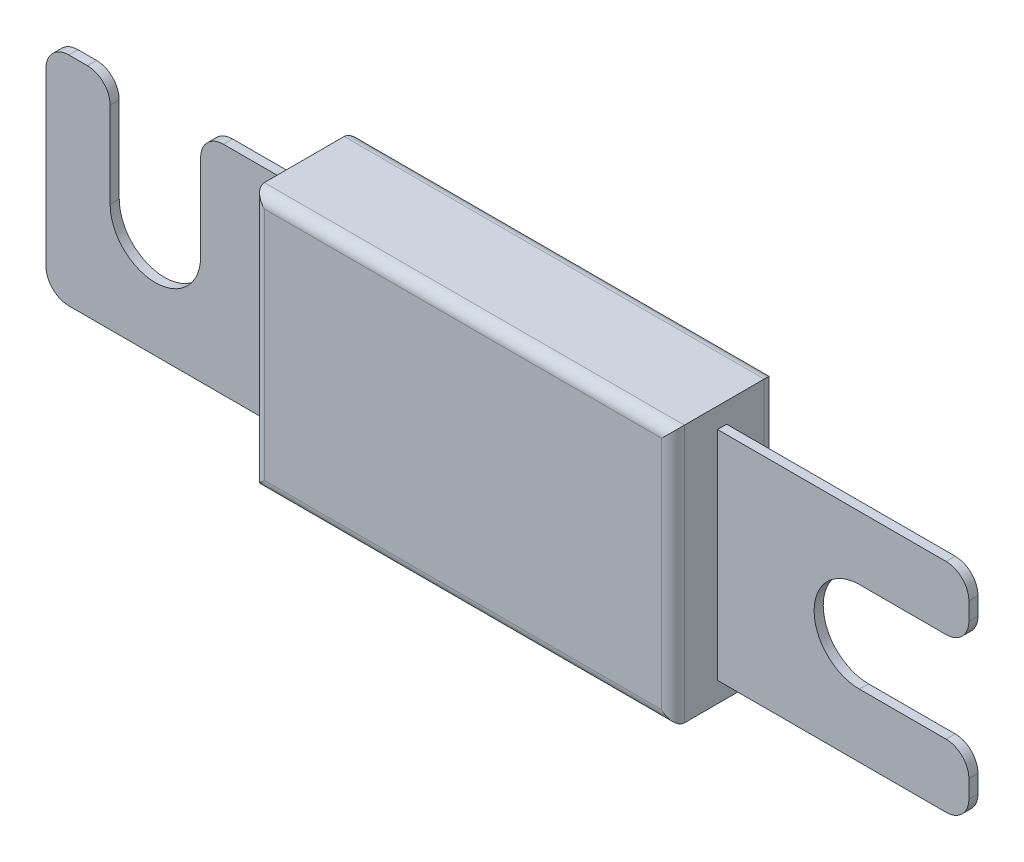
ISO-10303-21;
HEADER;
FILE_DESCRIPTION(('STEP AP214'),'2;1');
FILE_NAME('part.step','',(''),(''),'','','');
FILE_SCHEMA(('AUTOMOTIVE_DESIGN { 1 0 10303 214 1 1 1 1 }'));
ENDSEC;
DATA;
#1=APPLICATION_CONTEXT('core data for automotive mechanical design processes');
#2=APPLICATION_PROTOCOL_DEFINITION('international standard','automotive_design',2000,#1);
#3=PRODUCT_CONTEXT('',#1,'mechanical');
#4=PRODUCT('Part','Part','',(#3));
#5=PRODUCT_RELATED_PRODUCT_CATEGORY('part','',(#4));
#6=PRODUCT_DEFINITION_FORMATION('','',#4);
#7=PRODUCT_DEFINITION_CONTEXT('part definition',#1,'design');
#8=PRODUCT_DEFINITION('design','',#6,#7);
#9=PRODUCT_DEFINITION_SHAPE('','',#8);
#10=(LENGTH_UNIT() NAMED_UNIT(*) SI_UNIT(.MILLI.,.METRE.));
#11=(NAMED_UNIT(*) PLANE_ANGLE_UNIT() SI_UNIT($,.RADIAN.));
#12=(NAMED_UNIT(*) SI_UNIT($,.STERADIAN.) SOLID_ANGLE_UNIT());
#13=UNCERTAINTY_MEASURE_WITH_UNIT(LENGTH_MEASURE(1.E-05),#10,'distance_accuracy_value','');
#14=(GEOMETRIC_REPRESENTATION_CONTEXT(3) GLOBAL_UNCERTAINTY_ASSIGNED_CONTEXT((#13)) GLOBAL_UNIT_ASSIGNED_CONTEXT((#10,
#11,#12)) REPRESENTATION_CONTEXT('',''));
#15=CARTESIAN_POINT('',(0.,0.,0.));
#16=DIRECTION('',(0.,0.,1.));
#17=DIRECTION('',(1.,0.,0.));
#18=AXIS2_PLACEMENT_3D('',#15,#16,#17);
#19=CARTESIAN_POINT('',(78.91,0.,0.8));
#20=DIRECTION('',(0.,1.,0.));
#21=DIRECTION('',(-1.,0.,0.));
#22=AXIS2_PLACEMENT_3D('',#19,#20,#21);
#23=PLANE('',#22);
#24=DIRECTION('',(1.,0.,0.));
#25=VECTOR('',#24,1.);
#26=CARTESIAN_POINT('',(78.91,0.,0.));
#27=LINE('',#26,#25);
#28=CARTESIAN_POINT('',(2.00000000000002,0.,0.));
#29=VERTEX_POINT('',#28);
#30=CARTESIAN_POINT('',(22.04,0.,0.));
#31=VERTEX_POINT('',#30);
#32=EDGE_CURVE('E257',#29,#31,#27,.T.);
#33=ORIENTED_EDGE('',*,*,#32,.T.);
#34=DIRECTION('',(0.,0.,1.));
#35=VECTOR('',#34,1.);
#36=CARTESIAN_POINT('',(22.04,0.,0.8));
#37=LINE('',#36,#35);
#38=CARTESIAN_POINT('',(22.04,0.,0.8));
#39=VERTEX_POINT('',#38);
#40=EDGE_CURVE('E581',#31,#39,#37,.T.);
#41=ORIENTED_EDGE('',*,*,#40,.T.);
#42=DIRECTION('',(1.,0.,0.));
#43=VECTOR('',#42,1.);
#44=CARTESIAN_POINT('',(78.91,0.,0.8));
#45=LINE('',#44,#43);
#46=CARTESIAN_POINT('',(2.00000000000002,0.,0.8));
#47=VERTEX_POINT('',#46);
#48=EDGE_CURVE('E555',#47,#39,#45,.T.);
#49=ORIENTED_EDGE('',*,*,#48,.F.);
#50=DIRECTION('',(0.,0.,-1.));
#51=VECTOR('',#50,1.);
#52=CARTESIAN_POINT('',(2.00000000000002,0.,0.8));
#53=LINE('',#52,#51);
#54=EDGE_CURVE('E501',#47,#29,#53,.T.);
#55=ORIENTED_EDGE('',*,*,#54,.T.);
#56=EDGE_LOOP('',(#33,#41,#49,#55));
#57=FACE_BOUND('',#56,.T.);
#58=ADVANCED_FACE('F34',(#57),#23,.F.);
#59=CARTESIAN_POINT('',(15.55875,19.05,0.8));
#60=DIRECTION('',(0.,-1.,0.));
#61=DIRECTION('',(0.,0.,-1.));
#62=AXIS2_PLACEMENT_3D('',#59,#60,#61);
#63=PLANE('',#62);
#64=DIRECTION('',(-1.,0.,0.));
#65=VECTOR('',#64,1.);
#66=CARTESIAN_POINT('',(15.55875,19.05,0.8));
#67=LINE('',#66,#65);
#68=CARTESIAN_POINT('',(22.04,19.05,0.8));
#69=VERTEX_POINT('',#68);
#70=CARTESIAN_POINT('',(15.55875,19.05,0.8));
#71=VERTEX_POINT('',#70);
#72=EDGE_CURVE('E575',#69,#71,#67,.T.);
#73=ORIENTED_EDGE('',*,*,#72,.F.);
#74=DIRECTION('',(0.,0.,-1.));
#75=VECTOR('',#74,1.);
#76=CARTESIAN_POINT('',(22.04,19.05,0.8));
#77=LINE('',#76,#75);
#78=CARTESIAN_POINT('',(22.04,19.05,0.));
#79=VERTEX_POINT('',#78);
#80=EDGE_CURVE('E586',#69,#79,#77,.T.);
#81=ORIENTED_EDGE('',*,*,#80,.T.);
#82=DIRECTION('',(-1.,0.,0.));
#83=VECTOR('',#82,1.);
#84=CARTESIAN_POINT('',(15.55875,19.05,0.));
#85=LINE('',#84,#83);
#86=CARTESIAN_POINT('',(15.55875,19.05,0.));
#87=VERTEX_POINT('',#86);
#88=EDGE_CURVE('E471',#79,#87,#85,.T.);
#89=ORIENTED_EDGE('',*,*,#88,.T.);
#90=DIRECTION('',(0.,0.,-1.));
#91=VECTOR('',#90,1.);
#92=CARTESIAN_POINT('',(15.55875,19.05,0.8));
#93=LINE('',#92,#91);
#94=EDGE_CURVE('E475',#71,#87,#93,.T.);
#95=ORIENTED_EDGE('',*,*,#94,.F.);
#96=EDGE_LOOP('',(#73,#81,#89,#95));
#97=FACE_BOUND('',#96,.T.);
#98=ADVANCED_FACE('F375',(#97),#63,.F.);
#99=CARTESIAN_POINT('',(15.55875,17.05,0.8));
#100=DIRECTION('',(0.,0.,-1.));
#101=DIRECTION('',(-1.,0.,0.));
#102=AXIS2_PLACEMENT_3D('',#99,#100,#101);
#103=PLANE('',#102);
#104=ORIENTED_EDGE('',*,*,#48,.T.);
#105=DIRECTION('',(0.,1.,0.));
#106=VECTOR('',#105,1.);
#107=CARTESIAN_POINT('',(22.04,17.05,0.8));
#108=LINE('',#107,#106);
#109=EDGE_CURVE('E578',#39,#69,#108,.T.);
#110=ORIENTED_EDGE('',*,*,#109,.T.);
#111=ORIENTED_EDGE('',*,*,#72,.T.);
#112=CARTESIAN_POINT('',(15.55875,17.05,0.8));
#113=DIRECTION('',(0.,0.,1.));
#114=DIRECTION('',(-1.,0.,0.));
#115=AXIS2_PLACEMENT_3D('',#112,#113,#114);
#116=CIRCLE('',#115,2.);
#117=CARTESIAN_POINT('',(13.55875,17.05,0.8));
#118=VERTEX_POINT('',#117);
#119=EDGE_CURVE('E474',#71,#118,#116,.T.);
#120=ORIENTED_EDGE('',*,*,#119,.T.);
#121=DIRECTION('',(0.,-1.,0.));
#122=VECTOR('',#121,1.);
#123=CARTESIAN_POINT('',(13.55875,9.525,0.8));
#124=LINE('',#123,#122);
#125=CARTESIAN_POINT('',(13.55875,9.525,0.8));
#126=VERTEX_POINT('',#125);
#127=EDGE_CURVE('E592',#118,#126,#124,.T.);
#128=ORIENTED_EDGE('',*,*,#127,.T.);
#129=CARTESIAN_POINT('',(9.59,9.525,0.8));
#130=DIRECTION('',(0.,0.,-1.));
#131=DIRECTION('',(1.,0.,0.));
#132=AXIS2_PLACEMENT_3D('',#129,#130,#131);
#133=CIRCLE('',#132,3.96875);
#134=CARTESIAN_POINT('',(5.62125,9.525,0.8));
#135=VERTEX_POINT('',#134);
#136=EDGE_CURVE('E529',#126,#135,#133,.T.);
#137=ORIENTED_EDGE('',*,*,#136,.T.);
#138=DIRECTION('',(0.,1.,0.));
#139=VECTOR('',#138,1.);
#140=CARTESIAN_POINT('',(5.62125,9.525,0.8));
#141=LINE('',#140,#139);
#142=CARTESIAN_POINT('',(5.62125,17.05,0.8));
#143=VERTEX_POINT('',#142);
#144=EDGE_CURVE('E595',#135,#143,#141,.T.);
#145=ORIENTED_EDGE('',*,*,#144,.T.);
#146=CARTESIAN_POINT('',(3.62125,17.05,0.8));
#147=DIRECTION('',(0.,0.,1.));
#148=DIRECTION('',(1.,0.,0.));
#149=AXIS2_PLACEMENT_3D('',#146,#147,#148);
#150=CIRCLE('',#149,2.);
#151=CARTESIAN_POINT('',(3.62124999999998,19.05,0.8));
#152=VERTEX_POINT('',#151);
#153=EDGE_CURVE('E597',#143,#152,#150,.T.);
#154=ORIENTED_EDGE('',*,*,#153,.T.);
#155=DIRECTION('',(-1.,0.,0.));
#156=VECTOR('',#155,1.);
#157=CARTESIAN_POINT('',(2.00000000000003,19.05,0.8));
#158=LINE('',#157,#156);
#159=CARTESIAN_POINT('',(2.00000000000003,19.05,0.8));
#160=VERTEX_POINT('',#159);
#161=EDGE_CURVE('E599',#152,#160,#158,.T.);
#162=ORIENTED_EDGE('',*,*,#161,.T.);
#163=CARTESIAN_POINT('',(2.00000000000001,17.05,0.8));
#164=DIRECTION('',(0.,0.,1.));
#165=DIRECTION('',(-1.,0.,0.));
#166=AXIS2_PLACEMENT_3D('',#163,#164,#165);
#167=CIRCLE('',#166,2.);
#168=CARTESIAN_POINT('',(0.,17.05,0.8));
#169=VERTEX_POINT('',#168);
#170=EDGE_CURVE('E601',#160,#169,#167,.T.);
#171=ORIENTED_EDGE('',*,*,#170,.T.);
#172=DIRECTION('',(0.,-1.,0.));
#173=VECTOR('',#172,1.);
#174=CARTESIAN_POINT('',(0.,2.00000000000002,0.8));
#175=LINE('',#174,#173);
#176=CARTESIAN_POINT('',(0.,2.00000000000002,0.8));
#177=VERTEX_POINT('',#176);
#178=EDGE_CURVE('E603',#169,#177,#175,.T.);
#179=ORIENTED_EDGE('',*,*,#178,.T.);
#180=CARTESIAN_POINT('',(2.,2.,0.8));
#181=DIRECTION('',(0.,0.,1.));
#182=DIRECTION('',(1.,0.,0.));
#183=AXIS2_PLACEMENT_3D('',#180,#181,#182);
#184=CIRCLE('',#183,2.);
#185=EDGE_CURVE('E604',#177,#47,#184,.T.);
#186=ORIENTED_EDGE('',*,*,#185,.T.);
#187=EDGE_LOOP('',(#104,#110,#111,#120,#128,#137,#145,#154,#162,#171,#179,#186));
#188=FACE_BOUND('',#187,.T.);
#189=ADVANCED_FACE('F381',(#188),#103,.F.);
#190=CARTESIAN_POINT('',(15.55875,17.05,0.));
#191=DIRECTION('',(0.,0.,-1.));
#192=DIRECTION('',(-1.,0.,0.));
#193=AXIS2_PLACEMENT_3D('',#190,#191,#192);
#194=PLANE('',#193);
#195=DIRECTION('',(0.,1.,0.));
#196=VECTOR('',#195,1.);
#197=CARTESIAN_POINT('',(22.04,17.05,0.));
#198=LINE('',#197,#196);
#199=EDGE_CURVE('E272',#31,#79,#198,.T.);
#200=ORIENTED_EDGE('',*,*,#199,.F.);
#201=ORIENTED_EDGE('',*,*,#32,.F.);
#202=CARTESIAN_POINT('',(2.,2.,0.));
#203=DIRECTION('',(0.,0.,1.));
#204=DIRECTION('',(1.,0.,0.));
#205=AXIS2_PLACEMENT_3D('',#202,#203,#204);
#206=CIRCLE('',#205,2.);
#207=CARTESIAN_POINT('',(0.,2.00000000000002,0.));
#208=VERTEX_POINT('',#207);
#209=EDGE_CURVE('E258',#208,#29,#206,.T.);
#210=ORIENTED_EDGE('',*,*,#209,.F.);
#211=DIRECTION('',(0.,-1.,0.));
#212=VECTOR('',#211,1.);
#213=CARTESIAN_POINT('',(0.,2.00000000000002,0.));
#214=LINE('',#213,#212);
#215=CARTESIAN_POINT('',(0.,17.05,0.));
#216=VERTEX_POINT('',#215);
#217=EDGE_CURVE('E549',#216,#208,#214,.T.);
#218=ORIENTED_EDGE('',*,*,#217,.F.);
#219=CARTESIAN_POINT('',(2.00000000000001,17.05,0.));
#220=DIRECTION('',(0.,0.,1.));
#221=DIRECTION('',(-1.,0.,0.));
#222=AXIS2_PLACEMENT_3D('',#219,#220,#221);
#223=CIRCLE('',#222,2.);
#224=CARTESIAN_POINT('',(2.00000000000003,19.05,0.));
#225=VERTEX_POINT('',#224);
#226=EDGE_CURVE('E547',#225,#216,#223,.T.);
#227=ORIENTED_EDGE('',*,*,#226,.F.);
#228=DIRECTION('',(-1.,0.,0.));
#229=VECTOR('',#228,1.);
#230=CARTESIAN_POINT('',(2.00000000000003,19.05,0.));
#231=LINE('',#230,#229);
#232=CARTESIAN_POINT('',(3.62124999999998,19.05,0.));
#233=VERTEX_POINT('',#232);
#234=EDGE_CURVE('E545',#233,#225,#231,.T.);
#235=ORIENTED_EDGE('',*,*,#234,.F.);
#236=CARTESIAN_POINT('',(3.62125,17.05,0.));
#237=DIRECTION('',(0.,0.,1.));
#238=DIRECTION('',(1.,0.,0.));
#239=AXIS2_PLACEMENT_3D('',#236,#237,#238);
#240=CIRCLE('',#239,2.);
#241=CARTESIAN_POINT('',(5.62125,17.05,0.));
#242=VERTEX_POINT('',#241);
#243=EDGE_CURVE('E538',#242,#233,#240,.T.);
#244=ORIENTED_EDGE('',*,*,#243,.F.);
#245=DIRECTION('',(0.,1.,0.));
#246=VECTOR('',#245,1.);
#247=CARTESIAN_POINT('',(5.62125,9.525,0.));
#248=LINE('',#247,#246);
#249=CARTESIAN_POINT('',(5.62125,9.525,0.));
#250=VERTEX_POINT('',#249);
#251=EDGE_CURVE('E536',#250,#242,#248,.T.);
#252=ORIENTED_EDGE('',*,*,#251,.F.);
#253=CARTESIAN_POINT('',(9.59,9.525,0.));
#254=DIRECTION('',(0.,0.,-1.));
#255=DIRECTION('',(1.,0.,0.));
#256=AXIS2_PLACEMENT_3D('',#253,#254,#255);
#257=CIRCLE('',#256,3.96875);
#258=CARTESIAN_POINT('',(13.55875,9.525,0.));
#259=VERTEX_POINT('',#258);
#260=EDGE_CURVE('E528',#259,#250,#257,.T.);
#261=ORIENTED_EDGE('',*,*,#260,.F.);
#262=DIRECTION('',(0.,-1.,0.));
#263=VECTOR('',#262,1.);
#264=CARTESIAN_POINT('',(13.55875,9.525,0.));
#265=LINE('',#264,#263);
#266=CARTESIAN_POINT('',(13.55875,17.05,0.));
#267=VERTEX_POINT('',#266);
#268=EDGE_CURVE('E534',#267,#259,#265,.T.);
#269=ORIENTED_EDGE('',*,*,#268,.F.);
#270=CARTESIAN_POINT('',(15.55875,17.05,0.));
#271=DIRECTION('',(0.,0.,1.));
#272=DIRECTION('',(-1.,0.,0.));
#273=AXIS2_PLACEMENT_3D('',#270,#271,#272);
#274=CIRCLE('',#273,2.);
#275=EDGE_CURVE('E540',#87,#267,#274,.T.);
#276=ORIENTED_EDGE('',*,*,#275,.F.);
#277=ORIENTED_EDGE('',*,*,#88,.F.);
#278=EDGE_LOOP('',(#200,#201,#210,#218,#227,#235,#244,#252,#261,#269,#276,#277));
#279=FACE_BOUND('',#278,.T.);
#280=ADVANCED_FACE('F402',(#279),#194,.T.);
#281=CARTESIAN_POINT('',(15.55875,17.05,0.8));
#282=DIRECTION('',(0.,0.,-1.));
#283=DIRECTION('',(-1.,0.,0.));
#284=AXIS2_PLACEMENT_3D('',#281,#282,#283);
#285=CYLINDRICAL_SURFACE('',#284,2.);
#286=ORIENTED_EDGE('',*,*,#275,.T.);
#287=DIRECTION('',(0.,0.,-1.));
#288=VECTOR('',#287,1.);
#289=CARTESIAN_POINT('',(13.55875,17.05,0.8));
#290=LINE('',#289,#288);
#291=EDGE_CURVE('E273',#118,#267,#290,.T.);
#292=ORIENTED_EDGE('',*,*,#291,.F.);
#293=ORIENTED_EDGE('',*,*,#119,.F.);
#294=ORIENTED_EDGE('',*,*,#94,.T.);
#295=EDGE_LOOP('',(#286,#292,#293,#294));
#296=FACE_BOUND('',#295,.T.);
#297=ADVANCED_FACE('F651',(#296),#285,.T.);
#298=CARTESIAN_POINT('',(13.55875,9.525,0.8));
#299=DIRECTION('',(1.,0.,0.));
#300=DIRECTION('',(0.,0.,-1.));
#301=AXIS2_PLACEMENT_3D('',#298,#299,#300);
#302=PLANE('',#301);
#303=ORIENTED_EDGE('',*,*,#268,.T.);
#304=DIRECTION('',(0.,0.,-1.));
#305=VECTOR('',#304,1.);
#306=CARTESIAN_POINT('',(13.55875,9.525,0.8));
#307=LINE('',#306,#305);
#308=EDGE_CURVE('E279',#126,#259,#307,.T.);
#309=ORIENTED_EDGE('',*,*,#308,.F.);
#310=ORIENTED_EDGE('',*,*,#127,.F.);
#311=ORIENTED_EDGE('',*,*,#291,.T.);
#312=EDGE_LOOP('',(#303,#309,#310,#311));
#313=FACE_BOUND('',#312,.T.);
#314=ADVANCED_FACE('F657',(#313),#302,.F.);
#315=CARTESIAN_POINT('',(9.59,9.525,0.8));
#316=DIRECTION('',(0.,0.,-1.));
#317=DIRECTION('',(-1.,0.,0.));
#318=AXIS2_PLACEMENT_3D('',#315,#316,#317);
#319=CYLINDRICAL_SURFACE('',#318,3.96875);
#320=ORIENTED_EDGE('',*,*,#260,.T.);
#321=DIRECTION('',(0.,0.,-1.));
#322=VECTOR('',#321,1.);
#323=CARTESIAN_POINT('',(5.62125,9.525,0.8));
#324=LINE('',#323,#322);
#325=EDGE_CURVE('E519',#135,#250,#324,.T.);
#326=ORIENTED_EDGE('',*,*,#325,.F.);
#327=ORIENTED_EDGE('',*,*,#136,.F.);
#328=ORIENTED_EDGE('',*,*,#308,.T.);
#329=EDGE_LOOP('',(#320,#326,#327,#328));
#330=FACE_BOUND('',#329,.T.);
#331=ADVANCED_FACE('F526',(#330),#319,.F.);
#332=CARTESIAN_POINT('',(5.62125,9.525,0.8));
#333=DIRECTION('',(-1.,0.,0.));
#334=DIRECTION('',(0.,0.,1.));
#335=AXIS2_PLACEMENT_3D('',#332,#333,#334);
#336=PLANE('',#335);
#337=ORIENTED_EDGE('',*,*,#251,.T.);
#338=DIRECTION('',(0.,0.,-1.));
#339=VECTOR('',#338,1.);
#340=CARTESIAN_POINT('',(5.62125,17.05,0.8));
#341=LINE('',#340,#339);
#342=EDGE_CURVE('E516',#143,#242,#341,.T.);
#343=ORIENTED_EDGE('',*,*,#342,.F.);
#344=ORIENTED_EDGE('',*,*,#144,.F.);
#345=ORIENTED_EDGE('',*,*,#325,.T.);
#346=EDGE_LOOP('',(#337,#343,#344,#345));
#347=FACE_BOUND('',#346,.T.);
#348=ADVANCED_FACE('F664',(#347),#336,.F.);
#349=CARTESIAN_POINT('',(3.62125,17.05,0.8));
#350=DIRECTION('',(0.,0.,-1.));
#351=DIRECTION('',(-1.,0.,0.));
#352=AXIS2_PLACEMENT_3D('',#349,#350,#351);
#353=CYLINDRICAL_SURFACE('',#352,2.);
#354=ORIENTED_EDGE('',*,*,#243,.T.);
#355=DIRECTION('',(0.,0.,-1.));
#356=VECTOR('',#355,1.);
#357=CARTESIAN_POINT('',(3.62124999999998,19.05,0.8));
#358=LINE('',#357,#356);
#359=EDGE_CURVE('E513',#152,#233,#358,.T.);
#360=ORIENTED_EDGE('',*,*,#359,.F.);
#361=ORIENTED_EDGE('',*,*,#153,.F.);
#362=ORIENTED_EDGE('',*,*,#342,.T.);
#363=EDGE_LOOP('',(#354,#360,#361,#362));
#364=FACE_BOUND('',#363,.T.);
#365=ADVANCED_FACE('F905',(#364),#353,.T.);
#366=CARTESIAN_POINT('',(2.00000000000003,19.05,0.8));
#367=DIRECTION('',(0.,-1.,0.));
#368=DIRECTION('',(0.,0.,-1.));
#369=AXIS2_PLACEMENT_3D('',#366,#367,#368);
#370=PLANE('',#369);
#371=ORIENTED_EDGE('',*,*,#234,.T.);
#372=DIRECTION('',(0.,0.,-1.));
#373=VECTOR('',#372,1.);
#374=CARTESIAN_POINT('',(2.00000000000003,19.05,0.8));
#375=LINE('',#374,#373);
#376=EDGE_CURVE('E510',#160,#225,#375,.T.);
#377=ORIENTED_EDGE('',*,*,#376,.F.);
#378=ORIENTED_EDGE('',*,*,#161,.F.);
#379=ORIENTED_EDGE('',*,*,#359,.T.);
#380=EDGE_LOOP('',(#371,#377,#378,#379));
#381=FACE_BOUND('',#380,.T.);
#382=ADVANCED_FACE('F895',(#381),#370,.F.);
#383=CARTESIAN_POINT('',(2.00000000000001,17.05,0.8));
#384=DIRECTION('',(0.,0.,-1.));
#385=DIRECTION('',(-1.,0.,0.));
#386=AXIS2_PLACEMENT_3D('',#383,#384,#385);
#387=CYLINDRICAL_SURFACE('',#386,2.);
#388=ORIENTED_EDGE('',*,*,#226,.T.);
#389=DIRECTION('',(0.,0.,-1.));
#390=VECTOR('',#389,1.);
#391=CARTESIAN_POINT('',(0.,17.05,0.8));
#392=LINE('',#391,#390);
#393=EDGE_CURVE('E507',#169,#216,#392,.T.);
#394=ORIENTED_EDGE('',*,*,#393,.F.);
#395=ORIENTED_EDGE('',*,*,#170,.F.);
#396=ORIENTED_EDGE('',*,*,#376,.T.);
#397=EDGE_LOOP('',(#388,#394,#395,#396));
#398=FACE_BOUND('',#397,.T.);
#399=ADVANCED_FACE('F885',(#398),#387,.T.);
#400=CARTESIAN_POINT('',(0.,2.00000000000002,0.8));
#401=DIRECTION('',(1.,0.,0.));
#402=DIRECTION('',(0.,1.,0.));
#403=AXIS2_PLACEMENT_3D('',#400,#401,#402);
#404=PLANE('',#403);
#405=ORIENTED_EDGE('',*,*,#217,.T.);
#406=DIRECTION('',(0.,0.,-1.));
#407=VECTOR('',#406,1.);
#408=CARTESIAN_POINT('',(0.,2.00000000000002,0.8));
#409=LINE('',#408,#407);
#410=EDGE_CURVE('E504',#177,#208,#409,.T.);
#411=ORIENTED_EDGE('',*,*,#410,.F.);
#412=ORIENTED_EDGE('',*,*,#178,.F.);
#413=ORIENTED_EDGE('',*,*,#393,.T.);
#414=EDGE_LOOP('',(#405,#411,#412,#413));
#415=FACE_BOUND('',#414,.T.);
#416=ADVANCED_FACE('F876',(#415),#404,.F.);
#417=CARTESIAN_POINT('',(2.,2.,0.8));
#418=DIRECTION('',(0.,0.,-1.));
#419=DIRECTION('',(-1.,0.,0.));
#420=AXIS2_PLACEMENT_3D('',#417,#418,#419);
#421=CYLINDRICAL_SURFACE('',#420,2.);
#422=ORIENTED_EDGE('',*,*,#209,.T.);
#423=ORIENTED_EDGE('',*,*,#54,.F.);
#424=ORIENTED_EDGE('',*,*,#185,.F.);
#425=ORIENTED_EDGE('',*,*,#410,.T.);
#426=EDGE_LOOP('',(#422,#423,#424,#425));
#427=FACE_BOUND('',#426,.T.);
#428=ADVANCED_FACE('F640',(#427),#421,.T.);
#429=CARTESIAN_POINT('',(22.04,20.83,-4.3));
#430=DIRECTION('',(-1.,0.,0.));
#431=DIRECTION('',(0.,-1.,0.));
#432=AXIS2_PLACEMENT_3D('',#429,#430,#431);
#433=PLANE('',#432);
#434=DIRECTION('',(0.,0.,1.));
#435=VECTOR('',#434,1.);
#436=CARTESIAN_POINT('',(22.04,-1.78,-4.3));
#437=LINE('',#436,#435);
#438=CARTESIAN_POINT('',(22.04,-1.78,-3.3));
#439=VERTEX_POINT('',#438);
#440=CARTESIAN_POINT('',(22.04,-1.78,3.7));
#441=VERTEX_POINT('',#440);
#442=EDGE_CURVE('E311',#439,#441,#437,.T.);
#443=ORIENTED_EDGE('',*,*,#442,.T.);
#444=DIRECTION('',(0.,-1.,0.));
#445=VECTOR('',#444,1.);
#446=CARTESIAN_POINT('',(22.04,20.83,3.7));
#447=LINE('',#446,#445);
#448=CARTESIAN_POINT('',(22.04,20.83,3.7));
#449=VERTEX_POINT('',#448);
#450=EDGE_CURVE('E320',#441,#449,#447,.F.);
#451=ORIENTED_EDGE('',*,*,#450,.T.);
#452=DIRECTION('',(0.,0.,1.));
#453=VECTOR('',#452,1.);
#454=CARTESIAN_POINT('',(22.04,20.83,-4.3));
#455=LINE('',#454,#453);
#456=CARTESIAN_POINT('',(22.04,20.83,-3.3));
#457=VERTEX_POINT('',#456);
#458=EDGE_CURVE('E611',#457,#449,#455,.T.);
#459=ORIENTED_EDGE('',*,*,#458,.F.);
#460=DIRECTION('',(0.,-1.,0.));
#461=VECTOR('',#460,1.);
#462=CARTESIAN_POINT('',(22.04,20.83,-3.3));
#463=LINE('',#462,#461);
#464=EDGE_CURVE('E276',#457,#439,#463,.T.);
#465=ORIENTED_EDGE('',*,*,#464,.T.);
#466=EDGE_LOOP('',(#443,#451,#459,#465));
#467=FACE_BOUND('',#466,.T.);
#468=ORIENTED_EDGE('',*,*,#109,.F.);
#469=ORIENTED_EDGE('',*,*,#40,.F.);
#470=ORIENTED_EDGE('',*,*,#199,.T.);
#471=ORIENTED_EDGE('',*,*,#80,.F.);
#472=EDGE_LOOP('',(#468,#469,#470,#471));
#473=FACE_BOUND('',#472,.T.);
#474=ADVANCED_FACE('F351',(#467,#473),#433,.T.);
#475=CARTESIAN_POINT('',(58.87,20.83,-4.3));
#476=DIRECTION('',(1.,0.,0.));
#477=DIRECTION('',(0.,0.,-1.));
#478=AXIS2_PLACEMENT_3D('',#475,#476,#477);
#479=PLANE('',#478);
#480=DIRECTION('',(0.,0.,1.));
#481=VECTOR('',#480,1.);
#482=CARTESIAN_POINT('',(58.87,20.83,-4.3));
#483=LINE('',#482,#481);
#484=CARTESIAN_POINT('',(58.87,20.83,-3.3));
#485=VERTEX_POINT('',#484);
#486=CARTESIAN_POINT('',(58.87,20.83,3.7));
#487=VERTEX_POINT('',#486);
#488=EDGE_CURVE('E614',#485,#487,#483,.T.);
#489=ORIENTED_EDGE('',*,*,#488,.T.);
#490=DIRECTION('',(0.,1.,0.));
#491=VECTOR('',#490,1.);
#492=CARTESIAN_POINT('',(58.87,-1.77999999999999,3.7));
#493=LINE('',#492,#491);
#494=CARTESIAN_POINT('',(58.87,-1.77999999999999,3.7));
#495=VERTEX_POINT('',#494);
#496=EDGE_CURVE('E43',#487,#495,#493,.F.);
#497=ORIENTED_EDGE('',*,*,#496,.T.);
#498=DIRECTION('',(0.,0.,1.));
#499=VECTOR('',#498,1.);
#500=CARTESIAN_POINT('',(58.87,-1.77999999999999,-4.3));
#501=LINE('',#500,#499);
#502=CARTESIAN_POINT('',(58.87,-1.77999999999999,-3.3));
#503=VERTEX_POINT('',#502);
#504=EDGE_CURVE('E348',#503,#495,#501,.T.);
#505=ORIENTED_EDGE('',*,*,#504,.F.);
#506=DIRECTION('',(0.,1.,0.));
#507=VECTOR('',#506,1.);
#508=CARTESIAN_POINT('',(58.87,20.83,-3.3));
#509=LINE('',#508,#507);
#510=EDGE_CURVE('E296',#503,#485,#509,.T.);
#511=ORIENTED_EDGE('',*,*,#510,.T.);
#512=EDGE_LOOP('',(#489,#497,#505,#511));
#513=FACE_BOUND('',#512,.T.);
#514=DIRECTION('',(0.,-1.,0.));
#515=VECTOR('',#514,1.);
#516=CARTESIAN_POINT('',(58.87,17.05,0.8));
#517=LINE('',#516,#515);
#518=CARTESIAN_POINT('',(58.87,19.05,0.8));
#519=VERTEX_POINT('',#518);
#520=CARTESIAN_POINT('',(58.87,0.,0.8));
#521=VERTEX_POINT('',#520);
#522=EDGE_CURVE('E267',#519,#521,#517,.T.);
#523=ORIENTED_EDGE('',*,*,#522,.F.);
#524=DIRECTION('',(0.,0.,1.));
#525=VECTOR('',#524,1.);
#526=CARTESIAN_POINT('',(58.87,19.05,0.8));
#527=LINE('',#526,#525);
#528=CARTESIAN_POINT('',(58.87,19.05,0.));
#529=VERTEX_POINT('',#528);
#530=EDGE_CURVE('E268',#529,#519,#527,.T.);
#531=ORIENTED_EDGE('',*,*,#530,.F.);
#532=DIRECTION('',(0.,-1.,0.));
#533=VECTOR('',#532,1.);
#534=CARTESIAN_POINT('',(58.87,17.05,0.));
#535=LINE('',#534,#533);
#536=CARTESIAN_POINT('',(58.87,0.,0.));
#537=VERTEX_POINT('',#536);
#538=EDGE_CURVE('E250',#529,#537,#535,.T.);
#539=ORIENTED_EDGE('',*,*,#538,.T.);
#540=DIRECTION('',(0.,0.,-1.));
#541=VECTOR('',#540,1.);
#542=CARTESIAN_POINT('',(58.87,0.,0.8));
#543=LINE('',#542,#541);
#544=EDGE_CURVE('E262',#521,#537,#543,.T.);
#545=ORIENTED_EDGE('',*,*,#544,.F.);
#546=EDGE_LOOP('',(#523,#531,#539,#545));
#547=FACE_BOUND('',#546,.T.);
#548=ADVANCED_FACE('F271',(#513,#547),#479,.T.);
#549=CARTESIAN_POINT('',(58.87,20.83,-4.3));
#550=DIRECTION('',(0.,1.,0.));
#551=DIRECTION('',(-1.,0.,0.));
#552=AXIS2_PLACEMENT_3D('',#549,#550,#551);
#553=PLANE('',#552);
#554=ORIENTED_EDGE('',*,*,#458,.T.);
#555=DIRECTION('',(-1.,0.,0.));
#556=VECTOR('',#555,1.);
#557=CARTESIAN_POINT('',(58.87,20.83,3.7));
#558=LINE('',#557,#556);
#559=EDGE_CURVE('E58',#449,#487,#558,.F.);
#560=ORIENTED_EDGE('',*,*,#559,.T.);
#561=ORIENTED_EDGE('',*,*,#488,.F.);
#562=DIRECTION('',(-1.,0.,0.));
#563=VECTOR('',#562,1.);
#564=CARTESIAN_POINT('',(58.87,20.83,-3.3));
#565=LINE('',#564,#563);
#566=EDGE_CURVE('E294',#485,#457,#565,.T.);
#567=ORIENTED_EDGE('',*,*,#566,.T.);
#568=EDGE_LOOP('',(#554,#560,#561,#567));
#569=FACE_BOUND('',#568,.T.);
#570=ADVANCED_FACE('F616',(#569),#553,.T.);
#571=CARTESIAN_POINT('',(58.87,-1.77999999999999,-4.3));
#572=DIRECTION('',(0.,-1.,0.));
#573=DIRECTION('',(1.,0.,0.));
#574=AXIS2_PLACEMENT_3D('',#571,#572,#573);
#575=PLANE('',#574);
#576=ORIENTED_EDGE('',*,*,#504,.T.);
#577=DIRECTION('',(1.,0.,0.));
#578=VECTOR('',#577,1.);
#579=CARTESIAN_POINT('',(22.04,-1.78,3.7));
#580=LINE('',#579,#578);
#581=EDGE_CURVE('E11',#495,#441,#580,.F.);
#582=ORIENTED_EDGE('',*,*,#581,.T.);
#583=ORIENTED_EDGE('',*,*,#442,.F.);
#584=DIRECTION('',(1.,0.,0.));
#585=VECTOR('',#584,1.);
#586=CARTESIAN_POINT('',(58.87,-1.77999999999999,-3.3));
#587=LINE('',#586,#585);
#588=EDGE_CURVE('E298',#439,#503,#587,.T.);
#589=ORIENTED_EDGE('',*,*,#588,.T.);
#590=EDGE_LOOP('',(#576,#582,#583,#589));
#591=FACE_BOUND('',#590,.T.);
#592=ADVANCED_FACE('F347',(#591),#575,.T.);
#593=CARTESIAN_POINT('',(0.,0.,-4.3));
#594=DIRECTION('',(0.,0.,-1.));
#595=DIRECTION('',(-1.,0.,0.));
#596=AXIS2_PLACEMENT_3D('',#593,#594,#595);
#597=PLANE('',#596);
#598=DIRECTION('',(1.,0.,0.));
#599=VECTOR('',#598,1.);
#600=CARTESIAN_POINT('',(0.,-0.78,-4.3));
#601=LINE('',#600,#599);
#602=CARTESIAN_POINT('',(57.87,-0.779999999999992,-4.3));
#603=VERTEX_POINT('',#602);
#604=CARTESIAN_POINT('',(23.04,-0.779999999999997,-4.3));
#605=VERTEX_POINT('',#604);
#606=EDGE_CURVE('E285',#603,#605,#601,.F.);
#607=ORIENTED_EDGE('',*,*,#606,.T.);
#608=DIRECTION('',(0.,-1.,0.));
#609=VECTOR('',#608,1.);
#610=CARTESIAN_POINT('',(23.04,0.,-4.3));
#611=LINE('',#610,#609);
#612=CARTESIAN_POINT('',(23.04,19.83,-4.3));
#613=VERTEX_POINT('',#612);
#614=EDGE_CURVE('E291',#605,#613,#611,.F.);
#615=ORIENTED_EDGE('',*,*,#614,.T.);
#616=DIRECTION('',(-1.,0.,0.));
#617=VECTOR('',#616,1.);
#618=CARTESIAN_POINT('',(0.,19.83,-4.3));
#619=LINE('',#618,#617);
#620=CARTESIAN_POINT('',(57.87,19.83,-4.3));
#621=VERTEX_POINT('',#620);
#622=EDGE_CURVE('E289',#613,#621,#619,.F.);
#623=ORIENTED_EDGE('',*,*,#622,.T.);
#624=DIRECTION('',(0.,1.,0.));
#625=VECTOR('',#624,1.);
#626=CARTESIAN_POINT('',(57.87,0.,-4.3));
#627=LINE('',#626,#625);
#628=EDGE_CURVE('E287',#621,#603,#627,.F.);
#629=ORIENTED_EDGE('',*,*,#628,.T.);
#630=EDGE_LOOP('',(#607,#615,#623,#629));
#631=FACE_BOUND('',#630,.T.);
#632=ADVANCED_FACE('F363',(#631),#597,.T.);
#633=CARTESIAN_POINT('',(0.,0.,4.7));
#634=DIRECTION('',(0.,0.,-1.));
#635=DIRECTION('',(-1.,0.,0.));
#636=AXIS2_PLACEMENT_3D('',#633,#634,#635);
#637=PLANE('',#636);
#638=DIRECTION('',(-1.,0.,0.));
#639=VECTOR('',#638,1.);
#640=CARTESIAN_POINT('',(22.04,19.83,4.7));
#641=LINE('',#640,#639);
#642=CARTESIAN_POINT('',(57.87,19.83,4.7));
#643=VERTEX_POINT('',#642);
#644=CARTESIAN_POINT('',(23.04,19.83,4.7));
#645=VERTEX_POINT('',#644);
#646=EDGE_CURVE('E315',#643,#645,#641,.T.);
#647=ORIENTED_EDGE('',*,*,#646,.T.);
#648=DIRECTION('',(0.,-1.,0.));
#649=VECTOR('',#648,1.);
#650=CARTESIAN_POINT('',(23.04,-1.78,4.7));
#651=LINE('',#650,#649);
#652=CARTESIAN_POINT('',(23.04,-0.779999999999997,4.7));
#653=VERTEX_POINT('',#652);
#654=EDGE_CURVE('E317',#645,#653,#651,.T.);
#655=ORIENTED_EDGE('',*,*,#654,.T.);
#656=DIRECTION('',(1.,0.,0.));
#657=VECTOR('',#656,1.);
#658=CARTESIAN_POINT('',(58.87,-0.779999999999992,4.7));
#659=LINE('',#658,#657);
#660=CARTESIAN_POINT('',(57.87,-0.779999999999992,4.7));
#661=VERTEX_POINT('',#660);
#662=EDGE_CURVE('E300',#653,#661,#659,.T.);
#663=ORIENTED_EDGE('',*,*,#662,.T.);
#664=DIRECTION('',(0.,1.,0.));
#665=VECTOR('',#664,1.);
#666=CARTESIAN_POINT('',(57.87,20.83,4.7));
#667=LINE('',#666,#665);
#668=EDGE_CURVE('E313',#661,#643,#667,.T.);
#669=ORIENTED_EDGE('',*,*,#668,.T.);
#670=EDGE_LOOP('',(#647,#655,#663,#669));
#671=FACE_BOUND('',#670,.T.);
#672=ADVANCED_FACE('F360',(#671),#637,.F.);
#673=CARTESIAN_POINT('',(78.91,2.,0.8));
#674=DIRECTION('',(0.,0.,-1.));
#675=DIRECTION('',(-1.,0.,0.));
#676=AXIS2_PLACEMENT_3D('',#673,#674,#675);
#677=CYLINDRICAL_SURFACE('',#676,2.);
#678=CARTESIAN_POINT('',(78.91,2.,0.));
#679=DIRECTION('',(0.,0.,1.));
#680=DIRECTION('',(-1.,0.,0.));
#681=AXIS2_PLACEMENT_3D('',#678,#679,#680);
#682=CIRCLE('',#681,2.);
#683=CARTESIAN_POINT('',(78.91,0.,0.));
#684=VERTEX_POINT('',#683);
#685=CARTESIAN_POINT('',(80.91,2.00000000000001,0.));
#686=VERTEX_POINT('',#685);
#687=EDGE_CURVE('E253',#684,#686,#682,.T.);
#688=ORIENTED_EDGE('',*,*,#687,.T.);
#689=DIRECTION('',(0.,0.,-1.));
#690=VECTOR('',#689,1.);
#691=CARTESIAN_POINT('',(80.91,2.00000000000001,0.8));
#692=LINE('',#691,#690);
#693=CARTESIAN_POINT('',(80.91,2.00000000000001,0.8));
#694=VERTEX_POINT('',#693);
#695=EDGE_CURVE('E445',#694,#686,#692,.T.);
#696=ORIENTED_EDGE('',*,*,#695,.F.);
#697=CARTESIAN_POINT('',(78.91,2.,0.8));
#698=DIRECTION('',(0.,0.,1.));
#699=DIRECTION('',(-1.,0.,0.));
#700=AXIS2_PLACEMENT_3D('',#697,#698,#699);
#701=CIRCLE('',#700,2.);
#702=CARTESIAN_POINT('',(78.91,0.,0.8));
#703=VERTEX_POINT('',#702);
#704=EDGE_CURVE('E552',#703,#694,#701,.T.);
#705=ORIENTED_EDGE('',*,*,#704,.F.);
#706=DIRECTION('',(0.,0.,-1.));
#707=VECTOR('',#706,1.);
#708=CARTESIAN_POINT('',(78.91,0.,0.8));
#709=LINE('',#708,#707);
#710=EDGE_CURVE('E499',#703,#684,#709,.T.);
#711=ORIENTED_EDGE('',*,*,#710,.T.);
#712=EDGE_LOOP('',(#688,#696,#705,#711));
#713=FACE_BOUND('',#712,.T.);
#714=ADVANCED_FACE('F362',(#713),#677,.T.);
#715=CARTESIAN_POINT('',(80.91,3.55624999999999,0.8));
#716=DIRECTION('',(-1.,0.,0.));
#717=DIRECTION('',(0.,0.,1.));
#718=AXIS2_PLACEMENT_3D('',#715,#716,#717);
#719=PLANE('',#718);
#720=DIRECTION('',(0.,1.,0.));
#721=VECTOR('',#720,1.);
#722=CARTESIAN_POINT('',(80.91,3.55624999999999,0.));
#723=LINE('',#722,#721);
#724=CARTESIAN_POINT('',(80.91,3.55624999999999,0.));
#725=VERTEX_POINT('',#724);
#726=EDGE_CURVE('E439',#686,#725,#723,.T.);
#727=ORIENTED_EDGE('',*,*,#726,.T.);
#728=DIRECTION('',(0.,0.,-1.));
#729=VECTOR('',#728,1.);
#730=CARTESIAN_POINT('',(80.91,3.55624999999999,0.8));
#731=LINE('',#730,#729);
#732=CARTESIAN_POINT('',(80.91,3.55624999999999,0.8));
#733=VERTEX_POINT('',#732);
#734=EDGE_CURVE('E442',#733,#725,#731,.T.);
#735=ORIENTED_EDGE('',*,*,#734,.F.);
#736=DIRECTION('',(0.,1.,0.));
#737=VECTOR('',#736,1.);
#738=CARTESIAN_POINT('',(80.91,3.55624999999999,0.8));
#739=LINE('',#738,#737);
#740=EDGE_CURVE('E554',#694,#733,#739,.T.);
#741=ORIENTED_EDGE('',*,*,#740,.F.);
#742=ORIENTED_EDGE('',*,*,#695,.T.);
#743=EDGE_LOOP('',(#727,#735,#741,#742));
#744=FACE_BOUND('',#743,.T.);
#745=ADVANCED_FACE('F369',(#744),#719,.F.);
#746=CARTESIAN_POINT('',(78.91,3.55625000000001,0.8));
#747=DIRECTION('',(0.,0.,-1.));
#748=DIRECTION('',(-1.,0.,0.));
#749=AXIS2_PLACEMENT_3D('',#746,#747,#748);
#750=CYLINDRICAL_SURFACE('',#749,1.99999999999999);
#751=CARTESIAN_POINT('',(78.91,3.55625000000001,0.));
#752=DIRECTION('',(0.,0.,1.));
#753=DIRECTION('',(-1.,0.,0.));
#754=AXIS2_PLACEMENT_3D('',#751,#752,#753);
#755=CIRCLE('',#754,1.99999999999999);
#756=CARTESIAN_POINT('',(78.91,5.55625,0.));
#757=VERTEX_POINT('',#756);
#758=EDGE_CURVE('E447',#725,#757,#755,.T.);
#759=ORIENTED_EDGE('',*,*,#758,.T.);
#760=DIRECTION('',(0.,0.,-1.));
#761=VECTOR('',#760,1.);
#762=CARTESIAN_POINT('',(78.91,5.55625,0.8));
#763=LINE('',#762,#761);
#764=CARTESIAN_POINT('',(78.91,5.55625,0.8));
#765=VERTEX_POINT('',#764);
#766=EDGE_CURVE('E452',#765,#757,#763,.T.);
#767=ORIENTED_EDGE('',*,*,#766,.F.);
#768=CARTESIAN_POINT('',(78.91,3.55625000000001,0.8));
#769=DIRECTION('',(0.,0.,1.));
#770=DIRECTION('',(-1.,0.,0.));
#771=AXIS2_PLACEMENT_3D('',#768,#769,#770);
#772=CIRCLE('',#771,1.99999999999999);
#773=EDGE_CURVE('E451',#733,#765,#772,.T.);
#774=ORIENTED_EDGE('',*,*,#773,.F.);
#775=ORIENTED_EDGE('',*,*,#734,.T.);
#776=EDGE_LOOP('',(#759,#767,#774,#775));
#777=FACE_BOUND('',#776,.T.);
#778=ADVANCED_FACE('F428',(#777),#750,.T.);
#779=CARTESIAN_POINT('',(71.31,5.55625000000001,0.8));
#780=DIRECTION('',(0.,-1.,0.));
#781=DIRECTION('',(1.,0.,0.));
#782=AXIS2_PLACEMENT_3D('',#779,#780,#781);
#783=PLANE('',#782);
#784=DIRECTION('',(-1.,0.,0.));
#785=VECTOR('',#784,1.);
#786=CARTESIAN_POINT('',(71.31,5.55625000000001,0.));
#787=LINE('',#786,#785);
#788=CARTESIAN_POINT('',(71.31,5.55625000000001,0.));
#789=VERTEX_POINT('',#788);
#790=EDGE_CURVE('E456',#757,#789,#787,.T.);
#791=ORIENTED_EDGE('',*,*,#790,.T.);
#792=DIRECTION('',(0.,0.,-1.));
#793=VECTOR('',#792,1.);
#794=CARTESIAN_POINT('',(71.31,5.55625000000001,0.8));
#795=LINE('',#794,#793);
#796=CARTESIAN_POINT('',(71.31,5.55625000000001,0.8));
#797=VERTEX_POINT('',#796);
#798=EDGE_CURVE('E494',#797,#789,#795,.T.);
#799=ORIENTED_EDGE('',*,*,#798,.F.);
#800=DIRECTION('',(-1.,0.,0.));
#801=VECTOR('',#800,1.);
#802=CARTESIAN_POINT('',(71.31,5.55625000000001,0.8));
#803=LINE('',#802,#801);
#804=EDGE_CURVE('E563',#765,#797,#803,.T.);
#805=ORIENTED_EDGE('',*,*,#804,.F.);
#806=ORIENTED_EDGE('',*,*,#766,.T.);
#807=EDGE_LOOP('',(#791,#799,#805,#806));
#808=FACE_BOUND('',#807,.T.);
#809=ADVANCED_FACE('F424',(#808),#783,.F.);
#810=CARTESIAN_POINT('',(71.31,9.525,0.8));
#811=DIRECTION('',(0.,0.,-1.));
#812=DIRECTION('',(-1.,0.,0.));
#813=AXIS2_PLACEMENT_3D('',#810,#811,#812);
#814=CYLINDRICAL_SURFACE('',#813,3.96874999999999);
#815=CARTESIAN_POINT('',(71.31,9.525,0.));
#816=DIRECTION('',(0.,0.,-1.));
#817=DIRECTION('',(1.,0.,0.));
#818=AXIS2_PLACEMENT_3D('',#815,#816,#817);
#819=CIRCLE('',#818,3.96874999999999);
#820=CARTESIAN_POINT('',(71.31,13.49375,0.));
#821=VERTEX_POINT('',#820);
#822=EDGE_CURVE('E458',#789,#821,#819,.T.);
#823=ORIENTED_EDGE('',*,*,#822,.T.);
#824=DIRECTION('',(0.,0.,-1.));
#825=VECTOR('',#824,1.);
#826=CARTESIAN_POINT('',(71.31,13.49375,0.8));
#827=LINE('',#826,#825);
#828=CARTESIAN_POINT('',(71.31,13.49375,0.8));
#829=VERTEX_POINT('',#828);
#830=EDGE_CURVE('E491',#829,#821,#827,.T.);
#831=ORIENTED_EDGE('',*,*,#830,.F.);
#832=CARTESIAN_POINT('',(71.31,9.525,0.8));
#833=DIRECTION('',(0.,0.,-1.));
#834=DIRECTION('',(1.,0.,0.));
#835=AXIS2_PLACEMENT_3D('',#832,#833,#834);
#836=CIRCLE('',#835,3.96874999999999);
#837=EDGE_CURVE('E565',#797,#829,#836,.T.);
#838=ORIENTED_EDGE('',*,*,#837,.F.);
#839=ORIENTED_EDGE('',*,*,#798,.T.);
#840=EDGE_LOOP('',(#823,#831,#838,#839));
#841=FACE_BOUND('',#840,.T.);
#842=ADVANCED_FACE('F420',(#841),#814,.F.);
#843=CARTESIAN_POINT('',(71.31,13.49375,0.8));
#844=DIRECTION('',(0.,1.,0.));
#845=DIRECTION('',(0.,0.,1.));
#846=AXIS2_PLACEMENT_3D('',#843,#844,#845);
#847=PLANE('',#846);
#848=DIRECTION('',(1.,0.,0.));
#849=VECTOR('',#848,1.);
#850=CARTESIAN_POINT('',(71.31,13.49375,0.));
#851=LINE('',#850,#849);
#852=CARTESIAN_POINT('',(78.91,13.49375,0.));
#853=VERTEX_POINT('',#852);
#854=EDGE_CURVE('E463',#821,#853,#851,.T.);
#855=ORIENTED_EDGE('',*,*,#854,.T.);
#856=DIRECTION('',(0.,0.,-1.));
#857=VECTOR('',#856,1.);
#858=CARTESIAN_POINT('',(78.91,13.49375,0.8));
#859=LINE('',#858,#857);
#860=CARTESIAN_POINT('',(78.91,13.49375,0.8));
#861=VERTEX_POINT('',#860);
#862=EDGE_CURVE('E488',#861,#853,#859,.T.);
#863=ORIENTED_EDGE('',*,*,#862,.F.);
#864=DIRECTION('',(1.,0.,0.));
#865=VECTOR('',#864,1.);
#866=CARTESIAN_POINT('',(71.31,13.49375,0.8));
#867=LINE('',#866,#865);
#868=EDGE_CURVE('E567',#829,#861,#867,.T.);
#869=ORIENTED_EDGE('',*,*,#868,.F.);
#870=ORIENTED_EDGE('',*,*,#830,.T.);
#871=EDGE_LOOP('',(#855,#863,#869,#870));
#872=FACE_BOUND('',#871,.T.);
#873=ADVANCED_FACE('F416',(#872),#847,.F.);
#874=CARTESIAN_POINT('',(78.91,15.49375,0.8));
#875=DIRECTION('',(0.,0.,-1.));
#876=DIRECTION('',(-1.,0.,0.));
#877=AXIS2_PLACEMENT_3D('',#874,#875,#876);
#878=CYLINDRICAL_SURFACE('',#877,2.);
#879=CARTESIAN_POINT('',(78.91,15.49375,0.));
#880=DIRECTION('',(0.,0.,1.));
#881=DIRECTION('',(1.,0.,0.));
#882=AXIS2_PLACEMENT_3D('',#879,#880,#881);
#883=CIRCLE('',#882,2.);
#884=CARTESIAN_POINT('',(80.91,15.49375,0.));
#885=VERTEX_POINT('',#884);
#886=EDGE_CURVE('E465',#853,#885,#883,.T.);
#887=ORIENTED_EDGE('',*,*,#886,.T.);
#888=DIRECTION('',(0.,0.,-1.));
#889=VECTOR('',#888,1.);
#890=CARTESIAN_POINT('',(80.91,15.49375,0.8));
#891=LINE('',#890,#889);
#892=CARTESIAN_POINT('',(80.91,15.49375,0.8));
#893=VERTEX_POINT('',#892);
#894=EDGE_CURVE('E485',#893,#885,#891,.T.);
#895=ORIENTED_EDGE('',*,*,#894,.F.);
#896=CARTESIAN_POINT('',(78.91,15.49375,0.8));
#897=DIRECTION('',(0.,0.,1.));
#898=DIRECTION('',(1.,0.,0.));
#899=AXIS2_PLACEMENT_3D('',#896,#897,#898);
#900=CIRCLE('',#899,2.);
#901=EDGE_CURVE('E569',#861,#893,#900,.T.);
#902=ORIENTED_EDGE('',*,*,#901,.F.);
#903=ORIENTED_EDGE('',*,*,#862,.T.);
#904=EDGE_LOOP('',(#887,#895,#902,#903));
#905=FACE_BOUND('',#904,.T.);
#906=ADVANCED_FACE('F412',(#905),#878,.T.);
#907=CARTESIAN_POINT('',(80.91,17.05,0.8));
#908=DIRECTION('',(-1.,0.,0.));
#909=DIRECTION('',(0.,0.,1.));
#910=AXIS2_PLACEMENT_3D('',#907,#908,#909);
#911=PLANE('',#910);
#912=DIRECTION('',(0.,1.,0.));
#913=VECTOR('',#912,1.);
#914=CARTESIAN_POINT('',(80.91,17.05,0.));
#915=LINE('',#914,#913);
#916=CARTESIAN_POINT('',(80.91,17.05,0.));
#917=VERTEX_POINT('',#916);
#918=EDGE_CURVE('E467',#885,#917,#915,.T.);
#919=ORIENTED_EDGE('',*,*,#918,.T.);
#920=DIRECTION('',(0.,0.,-1.));
#921=VECTOR('',#920,1.);
#922=CARTESIAN_POINT('',(80.91,17.05,0.8));
#923=LINE('',#922,#921);
#924=CARTESIAN_POINT('',(80.91,17.05,0.8));
#925=VERTEX_POINT('',#924);
#926=EDGE_CURVE('E482',#925,#917,#923,.T.);
#927=ORIENTED_EDGE('',*,*,#926,.F.);
#928=DIRECTION('',(0.,1.,0.));
#929=VECTOR('',#928,1.);
#930=CARTESIAN_POINT('',(80.91,17.05,0.8));
#931=LINE('',#930,#929);
#932=EDGE_CURVE('E571',#893,#925,#931,.T.);
#933=ORIENTED_EDGE('',*,*,#932,.F.);
#934=ORIENTED_EDGE('',*,*,#894,.T.);
#935=EDGE_LOOP('',(#919,#927,#933,#934));
#936=FACE_BOUND('',#935,.T.);
#937=ADVANCED_FACE('F408',(#936),#911,.F.);
#938=CARTESIAN_POINT('',(78.91,17.05,0.8));
#939=DIRECTION('',(0.,0.,-1.));
#940=DIRECTION('',(-1.,0.,0.));
#941=AXIS2_PLACEMENT_3D('',#938,#939,#940);
#942=CYLINDRICAL_SURFACE('',#941,1.99999999999999);
#943=CARTESIAN_POINT('',(78.91,17.05,0.));
#944=DIRECTION('',(0.,0.,1.));
#945=DIRECTION('',(-1.,0.,0.));
#946=AXIS2_PLACEMENT_3D('',#943,#944,#945);
#947=CIRCLE('',#946,1.99999999999999);
#948=CARTESIAN_POINT('',(78.91,19.05,0.));
#949=VERTEX_POINT('',#948);
#950=EDGE_CURVE('E469',#917,#949,#947,.T.);
#951=ORIENTED_EDGE('',*,*,#950,.T.);
#952=DIRECTION('',(0.,0.,-1.));
#953=VECTOR('',#952,1.);
#954=CARTESIAN_POINT('',(78.91,19.05,0.8));
#955=LINE('',#954,#953);
#956=CARTESIAN_POINT('',(78.91,19.05,0.8));
#957=VERTEX_POINT('',#956);
#958=EDGE_CURVE('E478',#957,#949,#955,.T.);
#959=ORIENTED_EDGE('',*,*,#958,.F.);
#960=CARTESIAN_POINT('',(78.91,17.05,0.8));
#961=DIRECTION('',(0.,0.,1.));
#962=DIRECTION('',(-1.,0.,0.));
#963=AXIS2_PLACEMENT_3D('',#960,#961,#962);
#964=CIRCLE('',#963,1.99999999999999);
#965=EDGE_CURVE('E573',#925,#957,#964,.T.);
#966=ORIENTED_EDGE('',*,*,#965,.F.);
#967=ORIENTED_EDGE('',*,*,#926,.T.);
#968=EDGE_LOOP('',(#951,#959,#966,#967));
#969=FACE_BOUND('',#968,.T.);
#970=ADVANCED_FACE('F405',(#969),#942,.T.);
#971=EDGE_CURVE('E479',#957,#519,#67,.T.);
#972=ORIENTED_EDGE('',*,*,#971,.T.);
#973=ORIENTED_EDGE('',*,*,#522,.T.);
#974=EDGE_CURVE('E264',#521,#703,#45,.T.);
#975=ORIENTED_EDGE('',*,*,#974,.T.);
#976=ORIENTED_EDGE('',*,*,#704,.T.);
#977=ORIENTED_EDGE('',*,*,#740,.T.);
#978=ORIENTED_EDGE('',*,*,#773,.T.);
#979=ORIENTED_EDGE('',*,*,#804,.T.);
#980=ORIENTED_EDGE('',*,*,#837,.T.);
#981=ORIENTED_EDGE('',*,*,#868,.T.);
#982=ORIENTED_EDGE('',*,*,#901,.T.);
#983=ORIENTED_EDGE('',*,*,#932,.T.);
#984=ORIENTED_EDGE('',*,*,#965,.T.);
#985=EDGE_LOOP('',(#972,#973,#975,#976,#977,#978,#979,#980,#981,#982,#983,#984));
#986=FACE_BOUND('',#985,.T.);
#987=ADVANCED_FACE('F400',(#986),#103,.F.);
#988=ORIENTED_EDGE('',*,*,#538,.F.);
#989=EDGE_CURVE('E472',#949,#529,#85,.T.);
#990=ORIENTED_EDGE('',*,*,#989,.F.);
#991=ORIENTED_EDGE('',*,*,#950,.F.);
#992=ORIENTED_EDGE('',*,*,#918,.F.);
#993=ORIENTED_EDGE('',*,*,#886,.F.);
#994=ORIENTED_EDGE('',*,*,#854,.F.);
#995=ORIENTED_EDGE('',*,*,#822,.F.);
#996=ORIENTED_EDGE('',*,*,#790,.F.);
#997=ORIENTED_EDGE('',*,*,#758,.F.);
#998=ORIENTED_EDGE('',*,*,#726,.F.);
#999=ORIENTED_EDGE('',*,*,#687,.F.);
#1000=EDGE_CURVE('E245',#537,#684,#27,.T.);
#1001=ORIENTED_EDGE('',*,*,#1000,.F.);
#1002=EDGE_LOOP('',(#988,#990,#991,#992,#993,#994,#995,#996,#997,#998,#999,#1001));
#1003=FACE_BOUND('',#1002,.T.);
#1004=ADVANCED_FACE('F247',(#1003),#194,.T.);
#1005=ORIENTED_EDGE('',*,*,#989,.T.);
#1006=ORIENTED_EDGE('',*,*,#530,.T.);
#1007=ORIENTED_EDGE('',*,*,#971,.F.);
#1008=ORIENTED_EDGE('',*,*,#958,.T.);
#1009=EDGE_LOOP('',(#1005,#1006,#1007,#1008));
#1010=FACE_BOUND('',#1009,.T.);
#1011=ADVANCED_FACE('F384',(#1010),#63,.F.);
#1012=ORIENTED_EDGE('',*,*,#974,.F.);
#1013=ORIENTED_EDGE('',*,*,#544,.T.);
#1014=ORIENTED_EDGE('',*,*,#1000,.T.);
#1015=ORIENTED_EDGE('',*,*,#710,.F.);
#1016=EDGE_LOOP('',(#1012,#1013,#1014,#1015));
#1017=FACE_BOUND('',#1016,.T.);
#1018=ADVANCED_FACE('F263',(#1017),#23,.F.);
#1019=CARTESIAN_POINT('',(57.87,20.83,-3.3));
#1020=DIRECTION('',(0.,1.,0.));
#1021=DIRECTION('',(0.,0.,1.));
#1022=AXIS2_PLACEMENT_3D('',#1019,#1020,#1021);
#1023=CYLINDRICAL_SURFACE('',#1022,1.);
#1024=CARTESIAN_POINT('',(57.87,-0.779999999999992,-3.3));
#1025=DIRECTION('',(0.707106781186547,0.707106781186548,0.));
#1026=DIRECTION('',(0.707106781186548,-0.707106781186547,0.));
#1027=AXIS2_PLACEMENT_3D('',#1024,#1025,#1026);
#1028=ELLIPSE('',#1027,1.41421356237309,1.);
#1029=EDGE_CURVE('E305',#603,#503,#1028,.F.);
#1030=ORIENTED_EDGE('',*,*,#1029,.F.);
#1031=ORIENTED_EDGE('',*,*,#628,.F.);
#1032=CARTESIAN_POINT('',(57.87,19.83,-3.3));
#1033=DIRECTION('',(-0.707106781186548,0.707106781186547,0.));
#1034=DIRECTION('',(0.707106781186547,0.707106781186548,0.));
#1035=AXIS2_PLACEMENT_3D('',#1032,#1033,#1034);
#1036=ELLIPSE('',#1035,1.4142135623731,1.);
#1037=EDGE_CURVE('E308',#485,#621,#1036,.T.);
#1038=ORIENTED_EDGE('',*,*,#1037,.F.);
#1039=ORIENTED_EDGE('',*,*,#510,.F.);
#1040=EDGE_LOOP('',(#1030,#1031,#1038,#1039));
#1041=FACE_BOUND('',#1040,.T.);
#1042=ADVANCED_FACE('F388',(#1041),#1023,.T.);
#1043=CARTESIAN_POINT('',(58.87,19.83,-3.3));
#1044=DIRECTION('',(-1.,0.,0.));
#1045=DIRECTION('',(0.,-1.,0.));
#1046=AXIS2_PLACEMENT_3D('',#1043,#1044,#1045);
#1047=CYLINDRICAL_SURFACE('',#1046,1.);
#1048=ORIENTED_EDGE('',*,*,#1037,.T.);
#1049=ORIENTED_EDGE('',*,*,#622,.F.);
#1050=CARTESIAN_POINT('',(23.04,19.83,-3.3));
#1051=DIRECTION('',(-0.707106781186547,-0.707106781186548,0.));
#1052=DIRECTION('',(-0.707106781186548,0.707106781186547,0.));
#1053=AXIS2_PLACEMENT_3D('',#1050,#1051,#1052);
#1054=ELLIPSE('',#1053,1.4142135623731,1.);
#1055=EDGE_CURVE('E303',#457,#613,#1054,.T.);
#1056=ORIENTED_EDGE('',*,*,#1055,.F.);
#1057=ORIENTED_EDGE('',*,*,#566,.F.);
#1058=EDGE_LOOP('',(#1048,#1049,#1056,#1057));
#1059=FACE_BOUND('',#1058,.T.);
#1060=ADVANCED_FACE('F393',(#1059),#1047,.T.);
#1061=CARTESIAN_POINT('',(58.87,-0.779999999999992,-3.3));
#1062=DIRECTION('',(1.,0.,0.));
#1063=DIRECTION('',(0.,1.,0.));
#1064=AXIS2_PLACEMENT_3D('',#1061,#1062,#1063);
#1065=CYLINDRICAL_SURFACE('',#1064,1.);
#1066=ORIENTED_EDGE('',*,*,#1029,.T.);
#1067=ORIENTED_EDGE('',*,*,#588,.F.);
#1068=CARTESIAN_POINT('',(23.04,-0.779999999999996,-3.3));
#1069=DIRECTION('',(0.707106781186548,-0.707106781186547,0.));
#1070=DIRECTION('',(0.707106781186547,0.707106781186548,0.));
#1071=AXIS2_PLACEMENT_3D('',#1068,#1069,#1070);
#1072=ELLIPSE('',#1071,1.41421356237309,1.);
#1073=EDGE_CURVE('E301',#605,#439,#1072,.F.);
#1074=ORIENTED_EDGE('',*,*,#1073,.F.);
#1075=ORIENTED_EDGE('',*,*,#606,.F.);
#1076=EDGE_LOOP('',(#1066,#1067,#1074,#1075));
#1077=FACE_BOUND('',#1076,.T.);
#1078=ADVANCED_FACE('F628',(#1077),#1065,.T.);
#1079=CARTESIAN_POINT('',(23.04,20.83,-3.3));
#1080=DIRECTION('',(0.,-1.,0.));
#1081=DIRECTION('',(1.,0.,0.));
#1082=AXIS2_PLACEMENT_3D('',#1079,#1080,#1081);
#1083=CYLINDRICAL_SURFACE('',#1082,1.);
#1084=ORIENTED_EDGE('',*,*,#1055,.T.);
#1085=ORIENTED_EDGE('',*,*,#614,.F.);
#1086=ORIENTED_EDGE('',*,*,#1073,.T.);
#1087=ORIENTED_EDGE('',*,*,#464,.F.);
#1088=EDGE_LOOP('',(#1084,#1085,#1086,#1087));
#1089=FACE_BOUND('',#1088,.T.);
#1090=ADVANCED_FACE('F623',(#1089),#1083,.T.);
#1091=CARTESIAN_POINT('',(57.87,0.,3.7));
#1092=DIRECTION('',(0.,-1.,0.));
#1093=DIRECTION('',(0.,0.,-1.));
#1094=AXIS2_PLACEMENT_3D('',#1091,#1092,#1093);
#1095=CYLINDRICAL_SURFACE('',#1094,1.);
#1096=CARTESIAN_POINT('',(57.87,-0.779999999999992,3.7));
#1097=DIRECTION('',(-0.707106781186547,-0.707106781186548,0.));
#1098=DIRECTION('',(-0.707106781186548,0.707106781186547,0.));
#1099=AXIS2_PLACEMENT_3D('',#1096,#1097,#1098);
#1100=ELLIPSE('',#1099,1.41421356237309,1.);
#1101=EDGE_CURVE('E328',#495,#661,#1100,.T.);
#1102=ORIENTED_EDGE('',*,*,#1101,.F.);
#1103=ORIENTED_EDGE('',*,*,#496,.F.);
#1104=CARTESIAN_POINT('',(57.87,19.83,3.7));
#1105=DIRECTION('',(0.707106781186548,-0.707106781186547,0.));
#1106=DIRECTION('',(-0.707106781186547,-0.707106781186548,0.));
#1107=AXIS2_PLACEMENT_3D('',#1104,#1105,#1106);
#1108=ELLIPSE('',#1107,1.4142135623731,1.);
#1109=EDGE_CURVE('E38',#643,#487,#1108,.F.);
#1110=ORIENTED_EDGE('',*,*,#1109,.F.);
#1111=ORIENTED_EDGE('',*,*,#668,.F.);
#1112=EDGE_LOOP('',(#1102,#1103,#1110,#1111));
#1113=FACE_BOUND('',#1112,.T.);
#1114=ADVANCED_FACE('F36',(#1113),#1095,.T.);
#1115=CARTESIAN_POINT('',(0.,19.83,3.7));
#1116=DIRECTION('',(1.,0.,0.));
#1117=DIRECTION('',(0.,1.,0.));
#1118=AXIS2_PLACEMENT_3D('',#1115,#1116,#1117);
#1119=CYLINDRICAL_SURFACE('',#1118,1.);
#1120=ORIENTED_EDGE('',*,*,#1109,.T.);
#1121=ORIENTED_EDGE('',*,*,#559,.F.);
#1122=CARTESIAN_POINT('',(23.04,19.83,3.7));
#1123=DIRECTION('',(0.707106781186547,0.707106781186548,0.));
#1124=DIRECTION('',(0.707106781186548,-0.707106781186547,0.));
#1125=AXIS2_PLACEMENT_3D('',#1122,#1123,#1124);
#1126=ELLIPSE('',#1125,1.4142135623731,1.);
#1127=EDGE_CURVE('E327',#645,#449,#1126,.F.);
#1128=ORIENTED_EDGE('',*,*,#1127,.F.);
#1129=ORIENTED_EDGE('',*,*,#646,.F.);
#1130=EDGE_LOOP('',(#1120,#1121,#1128,#1129));
#1131=FACE_BOUND('',#1130,.T.);
#1132=ADVANCED_FACE('F338',(#1131),#1119,.T.);
#1133=CARTESIAN_POINT('',(0.,-0.78,3.7));
#1134=DIRECTION('',(-1.,0.,0.));
#1135=DIRECTION('',(0.,-1.,0.));
#1136=AXIS2_PLACEMENT_3D('',#1133,#1134,#1135);
#1137=CYLINDRICAL_SURFACE('',#1136,1.);
#1138=ORIENTED_EDGE('',*,*,#1101,.T.);
#1139=ORIENTED_EDGE('',*,*,#662,.F.);
#1140=CARTESIAN_POINT('',(23.04,-0.779999999999997,3.7));
#1141=DIRECTION('',(-0.707106781186548,0.707106781186547,0.));
#1142=DIRECTION('',(-0.707106781186547,-0.707106781186548,0.));
#1143=AXIS2_PLACEMENT_3D('',#1140,#1141,#1142);
#1144=ELLIPSE('',#1143,1.41421356237309,1.);
#1145=EDGE_CURVE('E325',#441,#653,#1144,.T.);
#1146=ORIENTED_EDGE('',*,*,#1145,.F.);
#1147=ORIENTED_EDGE('',*,*,#581,.F.);
#1148=EDGE_LOOP('',(#1138,#1139,#1146,#1147));
#1149=FACE_BOUND('',#1148,.T.);
#1150=ADVANCED_FACE('F343',(#1149),#1137,.T.);
#1151=CARTESIAN_POINT('',(23.04,0.,3.7));
#1152=DIRECTION('',(0.,1.,0.));
#1153=DIRECTION('',(-1.,0.,0.));
#1154=AXIS2_PLACEMENT_3D('',#1151,#1152,#1153);
#1155=CYLINDRICAL_SURFACE('',#1154,1.);
#1156=ORIENTED_EDGE('',*,*,#1127,.T.);
#1157=ORIENTED_EDGE('',*,*,#450,.F.);
#1158=ORIENTED_EDGE('',*,*,#1145,.T.);
#1159=ORIENTED_EDGE('',*,*,#654,.F.);
#1160=EDGE_LOOP('',(#1156,#1157,#1158,#1159));
#1161=FACE_BOUND('',#1160,.T.);
#1162=ADVANCED_FACE('F357',(#1161),#1155,.T.);
#1163=CLOSED_SHELL('',(#58,#98,#189,#280,#297,#314,#331,#348,#365,#382,#399,#416,#428,#474,#548,
#570,#592,#632,#672,#714,#745,#778,#809,#842,#873,#906,#937,#970,#987,#1004,#1011,#1018,#1042,
#1060,#1078,#1090,#1114,#1132,#1150,#1162));
#1164=MANIFOLD_SOLID_BREP('B2',#1163);
#1165=ADVANCED_BREP_SHAPE_REPRESENTATION('',(#18,#1164),#14);
#1166=SHAPE_DEFINITION_REPRESENTATION(#9,#1165);
ENDSEC;
END-ISO-10303-21;
